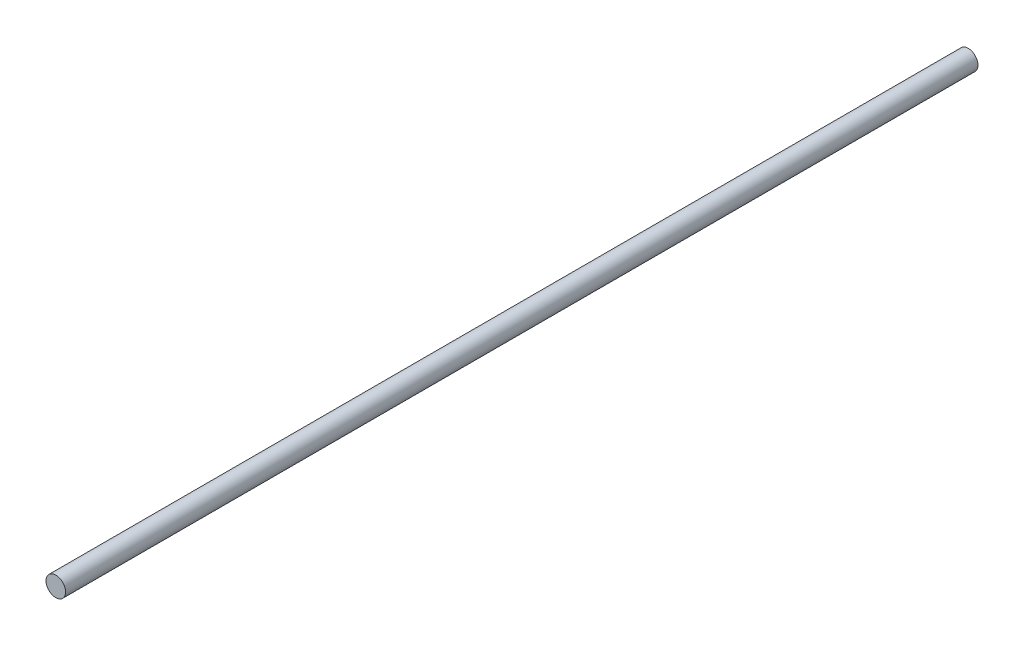
ISO-10303-21;
HEADER;
FILE_DESCRIPTION(('STEP AP214'),'2;1');
FILE_NAME('part.step','',(''),(''),'','','');
FILE_SCHEMA(('AUTOMOTIVE_DESIGN { 1 0 10303 214 1 1 1 1 }'));
ENDSEC;
DATA;
#1=APPLICATION_CONTEXT('core data for automotive mechanical design processes');
#2=APPLICATION_PROTOCOL_DEFINITION('international standard','automotive_design',2000,#1);
#3=PRODUCT_CONTEXT('',#1,'mechanical');
#4=PRODUCT('Part','Part','',(#3));
#5=PRODUCT_RELATED_PRODUCT_CATEGORY('part','',(#4));
#6=PRODUCT_DEFINITION_FORMATION('','',#4);
#7=PRODUCT_DEFINITION_CONTEXT('part definition',#1,'design');
#8=PRODUCT_DEFINITION('design','',#6,#7);
#9=PRODUCT_DEFINITION_SHAPE('','',#8);
#10=(LENGTH_UNIT() NAMED_UNIT(*) SI_UNIT(.MILLI.,.METRE.));
#11=(NAMED_UNIT(*) PLANE_ANGLE_UNIT() SI_UNIT($,.RADIAN.));
#12=(NAMED_UNIT(*) SI_UNIT($,.STERADIAN.) SOLID_ANGLE_UNIT());
#13=UNCERTAINTY_MEASURE_WITH_UNIT(LENGTH_MEASURE(1.E-05),#10,'distance_accuracy_value','');
#14=(GEOMETRIC_REPRESENTATION_CONTEXT(3) GLOBAL_UNCERTAINTY_ASSIGNED_CONTEXT((#13)) GLOBAL_UNIT_ASSIGNED_CONTEXT((#10,
#11,#12)) REPRESENTATION_CONTEXT('',''));
#15=CARTESIAN_POINT('',(0.,0.,0.));
#16=DIRECTION('',(0.,0.,1.));
#17=DIRECTION('',(1.,0.,0.));
#18=AXIS2_PLACEMENT_3D('',#15,#16,#17);
#19=CARTESIAN_POINT('',(0.,0.,373.));
#20=DIRECTION('',(0.,0.,-1.));
#21=DIRECTION('',(-1.,0.,0.));
#22=AXIS2_PLACEMENT_3D('',#19,#20,#21);
#23=CYLINDRICAL_SURFACE('',#22,4.);
#24=CARTESIAN_POINT('',(0.,0.,373.));
#25=DIRECTION('',(0.,0.,1.));
#26=DIRECTION('',(1.,0.,0.));
#27=AXIS2_PLACEMENT_3D('',#24,#25,#26);
#28=CIRCLE('',#27,4.);
#29=CARTESIAN_POINT('',(4.,0.,373.));
#30=VERTEX_POINT('',#29);
#31=EDGE_CURVE('E10',#30,#30,#28,.T.);
#32=ORIENTED_EDGE('',*,*,#31,.F.);
#33=EDGE_LOOP('',(#32));
#34=FACE_BOUND('',#33,.T.);
#35=CARTESIAN_POINT('',(0.,0.,0.));
#36=DIRECTION('',(0.,0.,1.));
#37=DIRECTION('',(1.,0.,0.));
#38=AXIS2_PLACEMENT_3D('',#35,#36,#37);
#39=CIRCLE('',#38,4.);
#40=CARTESIAN_POINT('',(4.,0.,0.));
#41=VERTEX_POINT('',#40);
#42=EDGE_CURVE('E38',#41,#41,#39,.T.);
#43=ORIENTED_EDGE('',*,*,#42,.T.);
#44=EDGE_LOOP('',(#43));
#45=FACE_BOUND('',#44,.T.);
#46=ADVANCED_FACE('F35',(#34,#45),#23,.T.);
#47=CARTESIAN_POINT('',(0.,0.,373.));
#48=DIRECTION('',(0.,0.,1.));
#49=DIRECTION('',(1.,0.,0.));
#50=AXIS2_PLACEMENT_3D('',#47,#48,#49);
#51=PLANE('',#50);
#52=ORIENTED_EDGE('',*,*,#31,.T.);
#53=EDGE_LOOP('',(#52));
#54=FACE_BOUND('',#53,.T.);
#55=ADVANCED_FACE('F50',(#54),#51,.T.);
#56=CARTESIAN_POINT('',(0.,0.,0.));
#57=DIRECTION('',(0.,0.,1.));
#58=DIRECTION('',(1.,0.,0.));
#59=AXIS2_PLACEMENT_3D('',#56,#57,#58);
#60=PLANE('',#59);
#61=ORIENTED_EDGE('',*,*,#42,.F.);
#62=EDGE_LOOP('',(#61));
#63=FACE_BOUND('',#62,.T.);
#64=ADVANCED_FACE('F48',(#63),#60,.F.);
#65=CLOSED_SHELL('',(#46,#55,#64));
#66=MANIFOLD_SOLID_BREP('B2',#65);
#67=ADVANCED_BREP_SHAPE_REPRESENTATION('',(#18,#66),#14);
#68=SHAPE_DEFINITION_REPRESENTATION(#9,#67);
ENDSEC;
END-ISO-10303-21;
